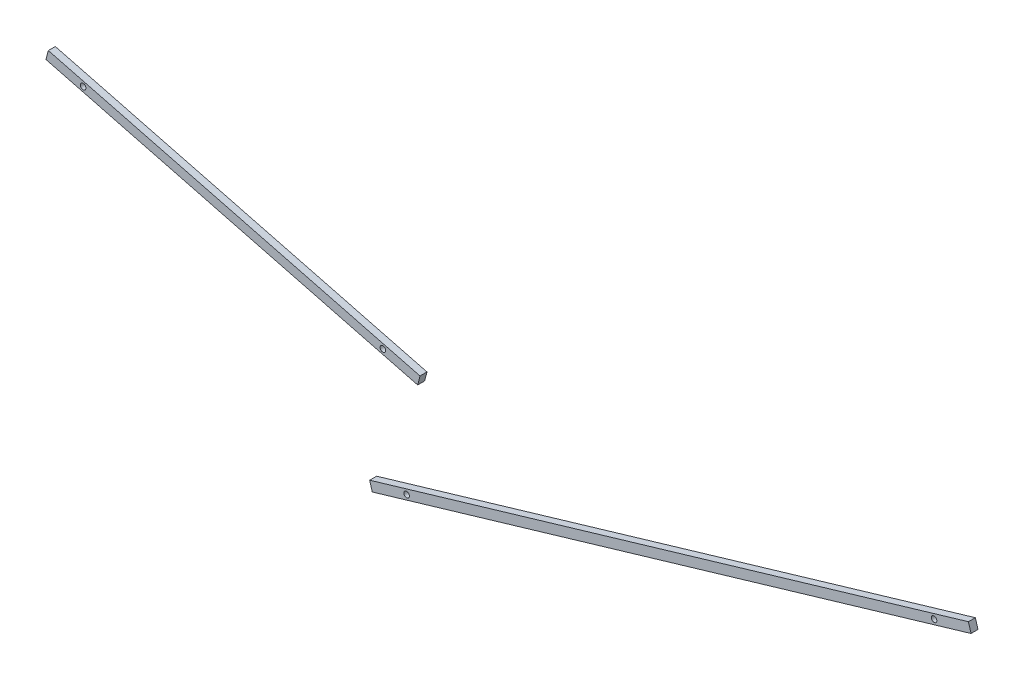
ISO-10303-21;
HEADER;
FILE_DESCRIPTION(('STEP AP214'),'2;1');
FILE_NAME('part.step','',(''),(''),'','','');
FILE_SCHEMA(('AUTOMOTIVE_DESIGN { 1 0 10303 214 1 1 1 1 }'));
ENDSEC;
DATA;
#1=APPLICATION_CONTEXT('core data for automotive mechanical design processes');
#2=APPLICATION_PROTOCOL_DEFINITION('international standard','automotive_design',2000,#1);
#3=PRODUCT_CONTEXT('',#1,'mechanical');
#4=PRODUCT('Part','Part','',(#3));
#5=PRODUCT_RELATED_PRODUCT_CATEGORY('part','',(#4));
#6=PRODUCT_DEFINITION_FORMATION('','',#4);
#7=PRODUCT_DEFINITION_CONTEXT('part definition',#1,'design');
#8=PRODUCT_DEFINITION('design','',#6,#7);
#9=PRODUCT_DEFINITION_SHAPE('','',#8);
#10=(LENGTH_UNIT() NAMED_UNIT(*) SI_UNIT(.MILLI.,.METRE.));
#11=(NAMED_UNIT(*) PLANE_ANGLE_UNIT() SI_UNIT($,.RADIAN.));
#12=(NAMED_UNIT(*) SI_UNIT($,.STERADIAN.) SOLID_ANGLE_UNIT());
#13=UNCERTAINTY_MEASURE_WITH_UNIT(LENGTH_MEASURE(1.E-05),#10,'distance_accuracy_value','');
#14=(GEOMETRIC_REPRESENTATION_CONTEXT(3) GLOBAL_UNCERTAINTY_ASSIGNED_CONTEXT((#13)) GLOBAL_UNIT_ASSIGNED_CONTEXT((#10,
#11,#12)) REPRESENTATION_CONTEXT('',''));
#15=CARTESIAN_POINT('',(0.,0.,0.));
#16=DIRECTION('',(0.,0.,1.));
#17=DIRECTION('',(1.,0.,0.));
#18=AXIS2_PLACEMENT_3D('',#15,#16,#17);
#19=CARTESIAN_POINT('',(795.224225990799,492.084261956328,4.7625));
#20=DIRECTION('',(-0.959052135794623,-0.283229590311062,0.));
#21=DIRECTION('',(0.283229590311062,-0.959052135794623,0.));
#22=AXIS2_PLACEMENT_3D('',#19,#20,#21);
#23=PLANE('',#22);
#24=DIRECTION('',(-0.283229590311062,0.959052135794623,0.));
#25=VECTOR('',#24,1.);
#26=CARTESIAN_POINT('',(795.224225990799,492.084261956328,0.));
#27=LINE('',#26,#25);
#28=CARTESIAN_POINT('',(797.022733889274,485.994280894032,0.));
#29=VERTEX_POINT('',#28);
#30=CARTESIAN_POINT('',(795.224225990799,492.084261956328,0.));
#31=VERTEX_POINT('',#30);
#32=EDGE_CURVE('E116',#29,#31,#27,.T.);
#33=ORIENTED_EDGE('',*,*,#32,.T.);
#34=DIRECTION('',(0.,0.,-1.));
#35=VECTOR('',#34,1.);
#36=CARTESIAN_POINT('',(795.224225990799,492.084261956328,4.7625));
#37=LINE('',#36,#35);
#38=CARTESIAN_POINT('',(795.224225990799,492.084261956328,4.7625));
#39=VERTEX_POINT('',#38);
#40=EDGE_CURVE('E12',#39,#31,#37,.T.);
#41=ORIENTED_EDGE('',*,*,#40,.F.);
#42=DIRECTION('',(-0.283229590311062,0.959052135794623,0.));
#43=VECTOR('',#42,1.);
#44=CARTESIAN_POINT('',(795.224225990799,492.084261956328,4.7625));
#45=LINE('',#44,#43);
#46=CARTESIAN_POINT('',(797.022733889274,485.994280894032,4.7625));
#47=VERTEX_POINT('',#46);
#48=EDGE_CURVE('E100',#47,#39,#45,.T.);
#49=ORIENTED_EDGE('',*,*,#48,.F.);
#50=DIRECTION('',(0.,0.,-1.));
#51=VECTOR('',#50,1.);
#52=CARTESIAN_POINT('',(797.022733889274,485.994280894032,4.7625));
#53=LINE('',#52,#51);
#54=EDGE_CURVE('E112',#47,#29,#53,.T.);
#55=ORIENTED_EDGE('',*,*,#54,.T.);
#56=EDGE_LOOP('',(#33,#41,#49,#55));
#57=FACE_BOUND('',#56,.T.);
#58=ADVANCED_FACE('F48',(#57),#23,.F.);
#59=CARTESIAN_POINT('',(795.224225990799,492.084261956328,4.7625));
#60=DIRECTION('',(0.28322959031105,-0.959052135794626,0.));
#61=DIRECTION('',(0.959052135794626,0.28322959031105,0.));
#62=AXIS2_PLACEMENT_3D('',#59,#60,#61);
#63=PLANE('',#62);
#64=DIRECTION('',(-0.959052135794626,-0.28322959031105,0.));
#65=VECTOR('',#64,1.);
#66=CARTESIAN_POINT('',(795.224225990799,492.084261956328,0.));
#67=LINE('',#66,#65);
#68=CARTESIAN_POINT('',(385.965820385253,371.221082338911,0.));
#69=VERTEX_POINT('',#68);
#70=EDGE_CURVE('E105',#31,#69,#67,.T.);
#71=ORIENTED_EDGE('',*,*,#70,.T.);
#72=DIRECTION('',(0.,0.,-1.));
#73=VECTOR('',#72,1.);
#74=CARTESIAN_POINT('',(385.965820385253,371.221082338911,4.7625));
#75=LINE('',#74,#73);
#76=CARTESIAN_POINT('',(385.965820385253,371.221082338911,4.7625));
#77=VERTEX_POINT('',#76);
#78=EDGE_CURVE('E57',#77,#69,#75,.T.);
#79=ORIENTED_EDGE('',*,*,#78,.F.);
#80=DIRECTION('',(-0.959052135794626,-0.28322959031105,0.));
#81=VECTOR('',#80,1.);
#82=CARTESIAN_POINT('',(795.224225990799,492.084261956328,4.7625));
#83=LINE('',#82,#81);
#84=EDGE_CURVE('E95',#39,#77,#83,.T.);
#85=ORIENTED_EDGE('',*,*,#84,.F.);
#86=ORIENTED_EDGE('',*,*,#40,.T.);
#87=EDGE_LOOP('',(#71,#79,#85,#86));
#88=FACE_BOUND('',#87,.T.);
#89=ADVANCED_FACE('F104',(#88),#63,.F.);
#90=CARTESIAN_POINT('',(385.965820385253,371.221082338911,4.7625));
#91=DIRECTION('',(0.959052135794628,0.283229590311043,0.));
#92=DIRECTION('',(-0.283229590311043,0.959052135794629,0.));
#93=AXIS2_PLACEMENT_3D('',#90,#91,#92);
#94=PLANE('',#93);
#95=DIRECTION('',(0.283229590311043,-0.959052135794628,0.));
#96=VECTOR('',#95,1.);
#97=CARTESIAN_POINT('',(385.965820385253,371.221082338911,0.));
#98=LINE('',#97,#96);
#99=CARTESIAN_POINT('',(387.764328283728,365.131101276615,0.));
#100=VERTEX_POINT('',#99);
#101=EDGE_CURVE('E82',#69,#100,#98,.T.);
#102=ORIENTED_EDGE('',*,*,#101,.T.);
#103=DIRECTION('',(0.,0.,-1.));
#104=VECTOR('',#103,1.);
#105=CARTESIAN_POINT('',(387.764328283728,365.131101276615,4.7625));
#106=LINE('',#105,#104);
#107=CARTESIAN_POINT('',(387.764328283728,365.131101276615,4.7625));
#108=VERTEX_POINT('',#107);
#109=EDGE_CURVE('E107',#108,#100,#106,.T.);
#110=ORIENTED_EDGE('',*,*,#109,.F.);
#111=DIRECTION('',(0.283229590311043,-0.959052135794628,0.));
#112=VECTOR('',#111,1.);
#113=CARTESIAN_POINT('',(385.965820385253,371.221082338911,4.7625));
#114=LINE('',#113,#112);
#115=EDGE_CURVE('E98',#77,#108,#114,.T.);
#116=ORIENTED_EDGE('',*,*,#115,.F.);
#117=ORIENTED_EDGE('',*,*,#78,.T.);
#118=EDGE_LOOP('',(#102,#110,#116,#117));
#119=FACE_BOUND('',#118,.T.);
#120=ADVANCED_FACE('F108',(#119),#94,.F.);
#121=CARTESIAN_POINT('',(797.022733889274,485.994280894032,4.7625));
#122=DIRECTION('',(-0.283229590311051,0.959052135794626,0.));
#123=DIRECTION('',(-0.959052135794626,-0.283229590311051,0.));
#124=AXIS2_PLACEMENT_3D('',#121,#122,#123);
#125=PLANE('',#124);
#126=DIRECTION('',(0.959052135794626,0.283229590311051,0.));
#127=VECTOR('',#126,1.);
#128=CARTESIAN_POINT('',(797.022733889274,485.994280894032,0.));
#129=LINE('',#128,#127);
#130=EDGE_CURVE('E88',#100,#29,#129,.T.);
#131=ORIENTED_EDGE('',*,*,#130,.T.);
#132=ORIENTED_EDGE('',*,*,#54,.F.);
#133=DIRECTION('',(0.959052135794626,0.283229590311051,0.));
#134=VECTOR('',#133,1.);
#135=CARTESIAN_POINT('',(797.022733889274,485.994280894032,4.7625));
#136=LINE('',#135,#134);
#137=EDGE_CURVE('E65',#108,#47,#136,.T.);
#138=ORIENTED_EDGE('',*,*,#137,.F.);
#139=ORIENTED_EDGE('',*,*,#109,.T.);
#140=EDGE_LOOP('',(#131,#132,#138,#139));
#141=FACE_BOUND('',#140,.T.);
#142=ADVANCED_FACE('F130',(#141),#125,.F.);
#143=CARTESIAN_POINT('',(0.,0.,4.7625));
#144=DIRECTION('',(0.,0.,-1.));
#145=DIRECTION('',(-1.,0.,0.));
#146=AXIS2_PLACEMENT_3D('',#143,#144,#145);
#147=PLANE('',#146);
#148=CARTESIAN_POINT('',(411.224998583674,375.370123401664,4.7625));
#149=DIRECTION('',(0.,0.,1.));
#150=DIRECTION('',(1.,0.,0.));
#151=AXIS2_PLACEMENT_3D('',#148,#149,#150);
#152=CIRCLE('',#151,1.89865);
#153=CARTESIAN_POINT('',(413.123648583674,375.370123401664,4.7625));
#154=VERTEX_POINT('',#153);
#155=EDGE_CURVE('E148',#154,#154,#152,.T.);
#156=ORIENTED_EDGE('',*,*,#155,.F.);
#157=EDGE_LOOP('',(#156));
#158=FACE_BOUND('',#157,.T.);
#159=CARTESIAN_POINT('',(771.763555690853,481.845239831279,4.7625));
#160=DIRECTION('',(0.,0.,1.));
#161=DIRECTION('',(1.,0.,0.));
#162=AXIS2_PLACEMENT_3D('',#159,#160,#161);
#163=CIRCLE('',#162,1.89865);
#164=CARTESIAN_POINT('',(773.662205690853,481.845239831279,4.7625));
#165=VERTEX_POINT('',#164);
#166=EDGE_CURVE('E140',#165,#165,#163,.T.);
#167=ORIENTED_EDGE('',*,*,#166,.F.);
#168=EDGE_LOOP('',(#167));
#169=FACE_BOUND('',#168,.T.);
#170=ORIENTED_EDGE('',*,*,#48,.T.);
#171=ORIENTED_EDGE('',*,*,#84,.T.);
#172=ORIENTED_EDGE('',*,*,#115,.T.);
#173=ORIENTED_EDGE('',*,*,#137,.T.);
#174=EDGE_LOOP('',(#170,#171,#172,#173));
#175=FACE_BOUND('',#174,.T.);
#176=ADVANCED_FACE('F96',(#158,#169,#175),#147,.F.);
#177=CARTESIAN_POINT('',(0.,0.,0.));
#178=DIRECTION('',(0.,0.,-1.));
#179=DIRECTION('',(-1.,0.,0.));
#180=AXIS2_PLACEMENT_3D('',#177,#178,#179);
#181=PLANE('',#180);
#182=CARTESIAN_POINT('',(411.224998583674,375.370123401664,0.));
#183=DIRECTION('',(0.,0.,1.));
#184=DIRECTION('',(1.,0.,0.));
#185=AXIS2_PLACEMENT_3D('',#182,#183,#184);
#186=CIRCLE('',#185,1.89865);
#187=CARTESIAN_POINT('',(413.123648583674,375.370123401664,0.));
#188=VERTEX_POINT('',#187);
#189=EDGE_CURVE('E144',#188,#188,#186,.T.);
#190=ORIENTED_EDGE('',*,*,#189,.T.);
#191=EDGE_LOOP('',(#190));
#192=FACE_BOUND('',#191,.T.);
#193=CARTESIAN_POINT('',(771.763555690853,481.845239831279,0.));
#194=DIRECTION('',(0.,0.,1.));
#195=DIRECTION('',(1.,0.,0.));
#196=AXIS2_PLACEMENT_3D('',#193,#194,#195);
#197=CIRCLE('',#196,1.89865);
#198=CARTESIAN_POINT('',(773.662205690853,481.845239831279,0.));
#199=VERTEX_POINT('',#198);
#200=EDGE_CURVE('E120',#199,#199,#197,.T.);
#201=ORIENTED_EDGE('',*,*,#200,.T.);
#202=EDGE_LOOP('',(#201));
#203=FACE_BOUND('',#202,.T.);
#204=ORIENTED_EDGE('',*,*,#32,.F.);
#205=ORIENTED_EDGE('',*,*,#130,.F.);
#206=ORIENTED_EDGE('',*,*,#101,.F.);
#207=ORIENTED_EDGE('',*,*,#70,.F.);
#208=EDGE_LOOP('',(#204,#205,#206,#207));
#209=FACE_BOUND('',#208,.T.);
#210=ADVANCED_FACE('F133',(#192,#203,#209),#181,.T.);
#211=CARTESIAN_POINT('',(771.763555690853,481.845239831279,4.7625));
#212=DIRECTION('',(0.,0.,1.));
#213=DIRECTION('',(1.,0.,0.));
#214=AXIS2_PLACEMENT_3D('',#211,#212,#213);
#215=CYLINDRICAL_SURFACE('',#214,1.89865);
#216=ORIENTED_EDGE('',*,*,#200,.F.);
#217=EDGE_LOOP('',(#216));
#218=FACE_BOUND('',#217,.T.);
#219=ORIENTED_EDGE('',*,*,#166,.T.);
#220=EDGE_LOOP('',(#219));
#221=FACE_BOUND('',#220,.T.);
#222=ADVANCED_FACE('F160',(#218,#221),#215,.F.);
#223=CARTESIAN_POINT('',(411.224998583674,375.370123401664,4.7625));
#224=DIRECTION('',(0.,0.,1.));
#225=DIRECTION('',(1.,0.,0.));
#226=AXIS2_PLACEMENT_3D('',#223,#224,#225);
#227=CYLINDRICAL_SURFACE('',#226,1.89865);
#228=ORIENTED_EDGE('',*,*,#189,.F.);
#229=EDGE_LOOP('',(#228));
#230=FACE_BOUND('',#229,.T.);
#231=ORIENTED_EDGE('',*,*,#155,.T.);
#232=EDGE_LOOP('',(#231));
#233=FACE_BOUND('',#232,.T.);
#234=ADVANCED_FACE('F153',(#230,#233),#227,.F.);
#235=CLOSED_SHELL('',(#58,#89,#120,#142,#176,#210,#222,#234));
#236=MANIFOLD_SOLID_BREP('B2',#235);
#237=CARTESIAN_POINT('',(420.373410583357,450.13359803982,4.7625));
#238=DIRECTION('',(-0.968232721065689,0.250050790556103,0.));
#239=DIRECTION('',(-0.250050790556103,-0.968232721065689,0.));
#240=AXIS2_PLACEMENT_3D('',#237,#238,#239);
#241=PLANE('',#240);
#242=DIRECTION('',(0.250050790556103,0.968232721065689,0.));
#243=VECTOR('',#242,1.);
#244=CARTESIAN_POINT('',(420.373410583357,450.13359803982,0.));
#245=LINE('',#244,#243);
#246=CARTESIAN_POINT('',(418.785588063325,443.985320261053,0.));
#247=VERTEX_POINT('',#246);
#248=CARTESIAN_POINT('',(420.373410583357,450.13359803982,0.));
#249=VERTEX_POINT('',#248);
#250=EDGE_CURVE('E292',#247,#249,#245,.T.);
#251=ORIENTED_EDGE('',*,*,#250,.T.);
#252=DIRECTION('',(0.,0.,-1.));
#253=VECTOR('',#252,1.);
#254=CARTESIAN_POINT('',(420.373410583357,450.13359803982,4.7625));
#255=LINE('',#254,#253);
#256=CARTESIAN_POINT('',(420.373410583357,450.13359803982,4.7625));
#257=VERTEX_POINT('',#256);
#258=EDGE_CURVE('E46',#257,#249,#255,.T.);
#259=ORIENTED_EDGE('',*,*,#258,.F.);
#260=DIRECTION('',(0.250050790556103,0.968232721065689,0.));
#261=VECTOR('',#260,1.);
#262=CARTESIAN_POINT('',(420.373410583357,450.13359803982,4.7625));
#263=LINE('',#262,#261);
#264=CARTESIAN_POINT('',(418.785588063325,443.985320261053,4.7625));
#265=VERTEX_POINT('',#264);
#266=EDGE_CURVE('E280',#265,#257,#263,.T.);
#267=ORIENTED_EDGE('',*,*,#266,.F.);
#268=DIRECTION('',(0.,0.,-1.));
#269=VECTOR('',#268,1.);
#270=CARTESIAN_POINT('',(418.785588063325,443.985320261053,4.7625));
#271=LINE('',#270,#269);
#272=EDGE_CURVE('E288',#265,#247,#271,.T.);
#273=ORIENTED_EDGE('',*,*,#272,.T.);
#274=EDGE_LOOP('',(#251,#259,#267,#273));
#275=FACE_BOUND('',#274,.T.);
#276=ADVANCED_FACE('F229',(#275),#241,.F.);
#277=CARTESIAN_POINT('',(420.373410583357,450.13359803982,4.7625));
#278=DIRECTION('',(-0.250050790556106,-0.968232721065688,0.));
#279=DIRECTION('',(0.968232721065688,-0.250050790556106,0.));
#280=AXIS2_PLACEMENT_3D('',#277,#278,#279);
#281=PLANE('',#280);
#282=DIRECTION('',(-0.968232721065688,0.250050790556106,0.));
#283=VECTOR('',#282,1.);
#284=CARTESIAN_POINT('',(420.373410583357,450.13359803982,0.));
#285=LINE('',#284,#283);
#286=CARTESIAN_POINT('',(166.308154013366,515.747181299269,0.));
#287=VERTEX_POINT('',#286);
#288=EDGE_CURVE('E284',#249,#287,#285,.T.);
#289=ORIENTED_EDGE('',*,*,#288,.T.);
#290=DIRECTION('',(0.,0.,-1.));
#291=VECTOR('',#290,1.);
#292=CARTESIAN_POINT('',(166.308154013366,515.747181299269,4.7625));
#293=LINE('',#292,#291);
#294=CARTESIAN_POINT('',(166.308154013366,515.747181299269,4.7625));
#295=VERTEX_POINT('',#294);
#296=EDGE_CURVE('E237',#295,#287,#293,.T.);
#297=ORIENTED_EDGE('',*,*,#296,.F.);
#298=DIRECTION('',(-0.968232721065688,0.250050790556106,0.));
#299=VECTOR('',#298,1.);
#300=CARTESIAN_POINT('',(420.373410583357,450.13359803982,4.7625));
#301=LINE('',#300,#299);
#302=EDGE_CURVE('E275',#257,#295,#301,.T.);
#303=ORIENTED_EDGE('',*,*,#302,.F.);
#304=ORIENTED_EDGE('',*,*,#258,.T.);
#305=EDGE_LOOP('',(#289,#297,#303,#304));
#306=FACE_BOUND('',#305,.T.);
#307=ADVANCED_FACE('F283',(#306),#281,.F.);
#308=CARTESIAN_POINT('',(166.308154013366,515.747181299269,4.7625));
#309=DIRECTION('',(0.968232721065689,-0.250050790556103,0.));
#310=DIRECTION('',(0.250050790556103,0.968232721065689,0.));
#311=AXIS2_PLACEMENT_3D('',#308,#309,#310);
#312=PLANE('',#311);
#313=DIRECTION('',(-0.250050790556103,-0.968232721065689,0.));
#314=VECTOR('',#313,1.);
#315=CARTESIAN_POINT('',(166.308154013366,515.747181299269,0.));
#316=LINE('',#315,#314);
#317=CARTESIAN_POINT('',(164.720331493335,509.598903520502,0.));
#318=VERTEX_POINT('',#317);
#319=EDGE_CURVE('E262',#287,#318,#316,.T.);
#320=ORIENTED_EDGE('',*,*,#319,.T.);
#321=DIRECTION('',(0.,0.,-1.));
#322=VECTOR('',#321,1.);
#323=CARTESIAN_POINT('',(164.720331493335,509.598903520502,4.7625));
#324=LINE('',#323,#322);
#325=CARTESIAN_POINT('',(164.720331493335,509.598903520502,4.7625));
#326=VERTEX_POINT('',#325);
#327=EDGE_CURVE('E285',#326,#318,#324,.T.);
#328=ORIENTED_EDGE('',*,*,#327,.F.);
#329=DIRECTION('',(-0.250050790556103,-0.968232721065689,0.));
#330=VECTOR('',#329,1.);
#331=CARTESIAN_POINT('',(166.308154013366,515.747181299269,4.7625));
#332=LINE('',#331,#330);
#333=EDGE_CURVE('E278',#295,#326,#332,.T.);
#334=ORIENTED_EDGE('',*,*,#333,.F.);
#335=ORIENTED_EDGE('',*,*,#296,.T.);
#336=EDGE_LOOP('',(#320,#328,#334,#335));
#337=FACE_BOUND('',#336,.T.);
#338=ADVANCED_FACE('F286',(#337),#312,.F.);
#339=CARTESIAN_POINT('',(418.785588063325,443.985320261053,4.7625));
#340=DIRECTION('',(0.250050790556106,0.968232721065688,0.));
#341=DIRECTION('',(-0.968232721065688,0.250050790556106,0.));
#342=AXIS2_PLACEMENT_3D('',#339,#340,#341);
#343=PLANE('',#342);
#344=DIRECTION('',(0.968232721065688,-0.250050790556106,0.));
#345=VECTOR('',#344,1.);
#346=CARTESIAN_POINT('',(418.785588063325,443.985320261053,0.));
#347=LINE('',#346,#345);
#348=EDGE_CURVE('E268',#318,#247,#347,.T.);
#349=ORIENTED_EDGE('',*,*,#348,.T.);
#350=ORIENTED_EDGE('',*,*,#272,.F.);
#351=DIRECTION('',(0.968232721065688,-0.250050790556106,0.));
#352=VECTOR('',#351,1.);
#353=CARTESIAN_POINT('',(418.785588063325,443.985320261053,4.7625));
#354=LINE('',#353,#352);
#355=EDGE_CURVE('E245',#326,#265,#354,.T.);
#356=ORIENTED_EDGE('',*,*,#355,.F.);
#357=ORIENTED_EDGE('',*,*,#327,.T.);
#358=EDGE_LOOP('',(#349,#350,#356,#357));
#359=FACE_BOUND('',#358,.T.);
#360=ADVANCED_FACE('F300',(#359),#343,.F.);
#361=CARTESIAN_POINT('',(0.,0.,4.7625));
#362=DIRECTION('',(0.,0.,-1.));
#363=DIRECTION('',(-1.,0.,0.));
#364=AXIS2_PLACEMENT_3D('',#361,#362,#363);
#365=PLANE('',#364);
#366=CARTESIAN_POINT('',(394.986388208273,453.410749230562,4.7625));
#367=DIRECTION('',(0.,0.,1.));
#368=DIRECTION('',(1.,0.,0.));
#369=AXIS2_PLACEMENT_3D('',#366,#367,#368);
#370=CIRCLE('',#369,1.89865);
#371=CARTESIAN_POINT('',(396.885038208273,453.410749230562,4.7625));
#372=VERTEX_POINT('',#371);
#373=EDGE_CURVE('E314',#372,#372,#370,.T.);
#374=ORIENTED_EDGE('',*,*,#373,.F.);
#375=EDGE_LOOP('',(#374));
#376=FACE_BOUND('',#375,.T.);
#377=CARTESIAN_POINT('',(190.107353868419,506.32175232976,4.7625));
#378=DIRECTION('',(0.,0.,1.));
#379=DIRECTION('',(1.,0.,0.));
#380=AXIS2_PLACEMENT_3D('',#377,#378,#379);
#381=CIRCLE('',#380,1.89865);
#382=CARTESIAN_POINT('',(192.006003868419,506.32175232976,4.7625));
#383=VERTEX_POINT('',#382);
#384=EDGE_CURVE('E308',#383,#383,#381,.T.);
#385=ORIENTED_EDGE('',*,*,#384,.F.);
#386=EDGE_LOOP('',(#385));
#387=FACE_BOUND('',#386,.T.);
#388=ORIENTED_EDGE('',*,*,#266,.T.);
#389=ORIENTED_EDGE('',*,*,#302,.T.);
#390=ORIENTED_EDGE('',*,*,#333,.T.);
#391=ORIENTED_EDGE('',*,*,#355,.T.);
#392=EDGE_LOOP('',(#388,#389,#390,#391));
#393=FACE_BOUND('',#392,.T.);
#394=ADVANCED_FACE('F276',(#376,#387,#393),#365,.F.);
#395=CARTESIAN_POINT('',(0.,0.,0.));
#396=DIRECTION('',(0.,0.,-1.));
#397=DIRECTION('',(-1.,0.,0.));
#398=AXIS2_PLACEMENT_3D('',#395,#396,#397);
#399=PLANE('',#398);
#400=CARTESIAN_POINT('',(394.986388208273,453.410749230562,0.));
#401=DIRECTION('',(0.,0.,1.));
#402=DIRECTION('',(1.,0.,0.));
#403=AXIS2_PLACEMENT_3D('',#400,#401,#402);
#404=CIRCLE('',#403,1.89865);
#405=CARTESIAN_POINT('',(396.885038208273,453.410749230562,0.));
#406=VERTEX_POINT('',#405);
#407=EDGE_CURVE('E311',#406,#406,#404,.T.);
#408=ORIENTED_EDGE('',*,*,#407,.T.);
#409=EDGE_LOOP('',(#408));
#410=FACE_BOUND('',#409,.T.);
#411=CARTESIAN_POINT('',(190.107353868419,506.32175232976,0.));
#412=DIRECTION('',(0.,0.,1.));
#413=DIRECTION('',(1.,0.,0.));
#414=AXIS2_PLACEMENT_3D('',#411,#412,#413);
#415=CIRCLE('',#414,1.89865);
#416=CARTESIAN_POINT('',(192.006003868419,506.32175232976,0.));
#417=VERTEX_POINT('',#416);
#418=EDGE_CURVE('E295',#417,#417,#415,.T.);
#419=ORIENTED_EDGE('',*,*,#418,.T.);
#420=EDGE_LOOP('',(#419));
#421=FACE_BOUND('',#420,.T.);
#422=ORIENTED_EDGE('',*,*,#250,.F.);
#423=ORIENTED_EDGE('',*,*,#348,.F.);
#424=ORIENTED_EDGE('',*,*,#319,.F.);
#425=ORIENTED_EDGE('',*,*,#288,.F.);
#426=EDGE_LOOP('',(#422,#423,#424,#425));
#427=FACE_BOUND('',#426,.T.);
#428=ADVANCED_FACE('F303',(#410,#421,#427),#399,.T.);
#429=CARTESIAN_POINT('',(190.107353868419,506.32175232976,4.7625));
#430=DIRECTION('',(0.,0.,1.));
#431=DIRECTION('',(1.,0.,0.));
#432=AXIS2_PLACEMENT_3D('',#429,#430,#431);
#433=CYLINDRICAL_SURFACE('',#432,1.89865);
#434=ORIENTED_EDGE('',*,*,#418,.F.);
#435=EDGE_LOOP('',(#434));
#436=FACE_BOUND('',#435,.T.);
#437=ORIENTED_EDGE('',*,*,#384,.T.);
#438=EDGE_LOOP('',(#437));
#439=FACE_BOUND('',#438,.T.);
#440=ADVANCED_FACE('F325',(#436,#439),#433,.F.);
#441=CARTESIAN_POINT('',(394.986388208273,453.410749230562,4.7625));
#442=DIRECTION('',(0.,0.,1.));
#443=DIRECTION('',(1.,0.,0.));
#444=AXIS2_PLACEMENT_3D('',#441,#442,#443);
#445=CYLINDRICAL_SURFACE('',#444,1.89865);
#446=ORIENTED_EDGE('',*,*,#407,.F.);
#447=EDGE_LOOP('',(#446));
#448=FACE_BOUND('',#447,.T.);
#449=ORIENTED_EDGE('',*,*,#373,.T.);
#450=EDGE_LOOP('',(#449));
#451=FACE_BOUND('',#450,.T.);
#452=ADVANCED_FACE('F318',(#448,#451),#445,.F.);
#453=CLOSED_SHELL('',(#276,#307,#338,#360,#394,#428,#440,#452));
#454=MANIFOLD_SOLID_BREP('B6',#453);
#455=ADVANCED_BREP_SHAPE_REPRESENTATION('',(#18,#236,#454),#14);
#456=SHAPE_DEFINITION_REPRESENTATION(#9,#455);
ENDSEC;
END-ISO-10303-21;
